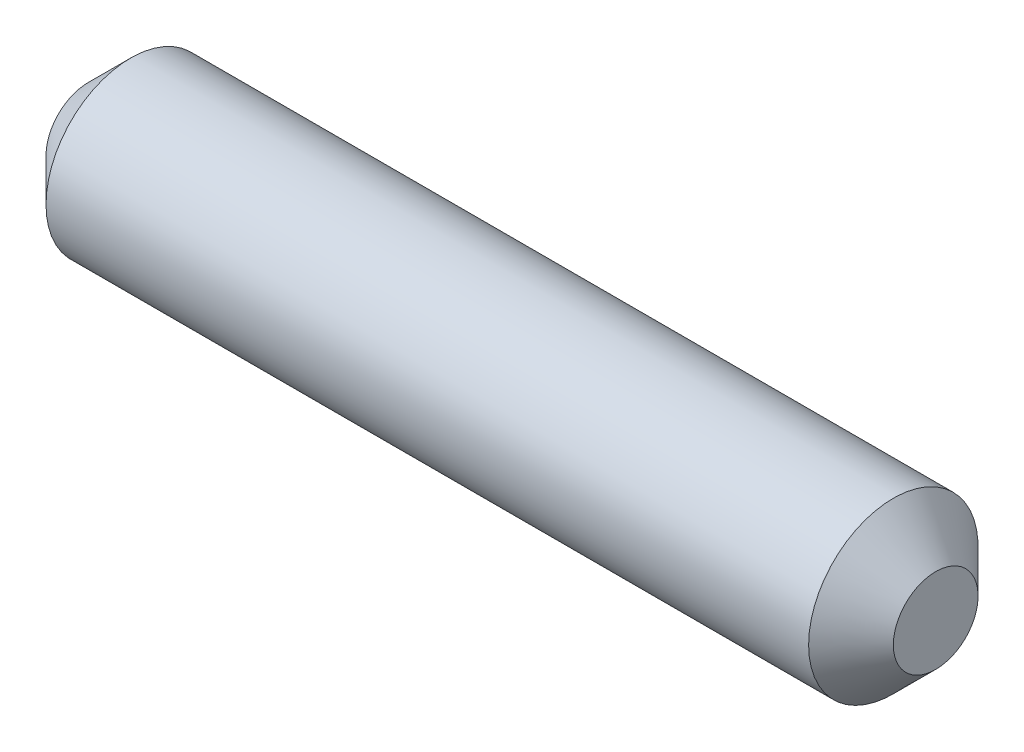
ISO-10303-21;
HEADER;
FILE_DESCRIPTION(('STEP AP214'),'2;1');
FILE_NAME('part.step','',(''),(''),'','','');
FILE_SCHEMA(('AUTOMOTIVE_DESIGN { 1 0 10303 214 1 1 1 1 }'));
ENDSEC;
DATA;
#1=APPLICATION_CONTEXT('core data for automotive mechanical design processes');
#2=APPLICATION_PROTOCOL_DEFINITION('international standard','automotive_design',2000,#1);
#3=PRODUCT_CONTEXT('',#1,'mechanical');
#4=PRODUCT('Part','Part','',(#3));
#5=PRODUCT_RELATED_PRODUCT_CATEGORY('part','',(#4));
#6=PRODUCT_DEFINITION_FORMATION('','',#4);
#7=PRODUCT_DEFINITION_CONTEXT('part definition',#1,'design');
#8=PRODUCT_DEFINITION('design','',#6,#7);
#9=PRODUCT_DEFINITION_SHAPE('','',#8);
#10=(LENGTH_UNIT() NAMED_UNIT(*) SI_UNIT(.MILLI.,.METRE.));
#11=(NAMED_UNIT(*) PLANE_ANGLE_UNIT() SI_UNIT($,.RADIAN.));
#12=(NAMED_UNIT(*) SI_UNIT($,.STERADIAN.) SOLID_ANGLE_UNIT());
#13=UNCERTAINTY_MEASURE_WITH_UNIT(LENGTH_MEASURE(1.E-05),#10,'distance_accuracy_value','');
#14=(GEOMETRIC_REPRESENTATION_CONTEXT(3) GLOBAL_UNCERTAINTY_ASSIGNED_CONTEXT((#13)) GLOBAL_UNIT_ASSIGNED_CONTEXT((#10,
#11,#12)) REPRESENTATION_CONTEXT('',''));
#15=CARTESIAN_POINT('',(0.,0.,0.));
#16=DIRECTION('',(0.,0.,1.));
#17=DIRECTION('',(1.,0.,0.));
#18=AXIS2_PLACEMENT_3D('',#15,#16,#17);
#19=CARTESIAN_POINT('',(0.,0.,0.));
#20=DIRECTION('',(1.,0.,0.));
#21=DIRECTION('',(0.,0.,-1.));
#22=AXIS2_PLACEMENT_3D('',#19,#20,#21);
#23=PLANE('',#22);
#24=CARTESIAN_POINT('',(0.,0.,0.));
#25=DIRECTION('',(-1.,0.,0.));
#26=DIRECTION('',(0.,0.,1.));
#27=AXIS2_PLACEMENT_3D('',#24,#25,#26);
#28=CIRCLE('',#27,1.);
#29=CARTESIAN_POINT('',(0.,0.,1.));
#30=VERTEX_POINT('',#29);
#31=EDGE_CURVE('E10',#30,#30,#28,.T.);
#32=ORIENTED_EDGE('',*,*,#31,.T.);
#33=EDGE_LOOP('',(#32));
#34=FACE_BOUND('',#33,.T.);
#35=ADVANCED_FACE('F29',(#34),#23,.F.);
#36=CARTESIAN_POINT('',(1.,0.,0.));
#37=DIRECTION('',(1.,0.,0.));
#38=DIRECTION('',(0.,0.,-1.));
#39=AXIS2_PLACEMENT_3D('',#36,#37,#38);
#40=CONICAL_SURFACE('',#39,2.,0.785398163397448);
#41=ORIENTED_EDGE('',*,*,#31,.F.);
#42=EDGE_LOOP('',(#41));
#43=FACE_BOUND('',#42,.T.);
#44=CARTESIAN_POINT('',(1.,0.,0.));
#45=DIRECTION('',(-1.,0.,0.));
#46=DIRECTION('',(0.,0.,1.));
#47=AXIS2_PLACEMENT_3D('',#44,#45,#46);
#48=CIRCLE('',#47,2.);
#49=CARTESIAN_POINT('',(1.,0.,2.));
#50=VERTEX_POINT('',#49);
#51=EDGE_CURVE('E35',#50,#50,#48,.T.);
#52=ORIENTED_EDGE('',*,*,#51,.T.);
#53=EDGE_LOOP('',(#52));
#54=FACE_BOUND('',#53,.T.);
#55=ADVANCED_FACE('F61',(#43,#54),#40,.T.);
#56=CARTESIAN_POINT('',(-64.5454939341421,0.,0.));
#57=DIRECTION('',(-1.,0.,0.));
#58=DIRECTION('',(0.,0.,1.));
#59=AXIS2_PLACEMENT_3D('',#56,#57,#58);
#60=CYLINDRICAL_SURFACE('',#59,2.);
#61=ORIENTED_EDGE('',*,*,#51,.F.);
#62=EDGE_LOOP('',(#61));
#63=FACE_BOUND('',#62,.T.);
#64=CARTESIAN_POINT('',(19.,0.,0.));
#65=DIRECTION('',(-1.,0.,0.));
#66=DIRECTION('',(0.,0.,1.));
#67=AXIS2_PLACEMENT_3D('',#64,#65,#66);
#68=CIRCLE('',#67,2.);
#69=CARTESIAN_POINT('',(19.,0.,2.));
#70=VERTEX_POINT('',#69);
#71=EDGE_CURVE('E39',#70,#70,#68,.T.);
#72=ORIENTED_EDGE('',*,*,#71,.T.);
#73=EDGE_LOOP('',(#72));
#74=FACE_BOUND('',#73,.T.);
#75=ADVANCED_FACE('F57',(#63,#74),#60,.T.);
#76=CARTESIAN_POINT('',(20.,0.,0.));
#77=DIRECTION('',(-1.,0.,0.));
#78=DIRECTION('',(0.,0.,1.));
#79=AXIS2_PLACEMENT_3D('',#76,#77,#78);
#80=CONICAL_SURFACE('',#79,1.,0.785398163397448);
#81=ORIENTED_EDGE('',*,*,#71,.F.);
#82=EDGE_LOOP('',(#81));
#83=FACE_BOUND('',#82,.T.);
#84=CARTESIAN_POINT('',(20.,0.,0.));
#85=DIRECTION('',(-1.,0.,0.));
#86=DIRECTION('',(0.,0.,1.));
#87=AXIS2_PLACEMENT_3D('',#84,#85,#86);
#88=CIRCLE('',#87,1.);
#89=CARTESIAN_POINT('',(20.,0.,1.));
#90=VERTEX_POINT('',#89);
#91=EDGE_CURVE('E43',#90,#90,#88,.T.);
#92=ORIENTED_EDGE('',*,*,#91,.T.);
#93=EDGE_LOOP('',(#92));
#94=FACE_BOUND('',#93,.T.);
#95=ADVANCED_FACE('F49',(#83,#94),#80,.T.);
#96=CARTESIAN_POINT('',(20.,1.,0.));
#97=DIRECTION('',(-1.,0.,0.));
#98=DIRECTION('',(0.,0.,1.));
#99=AXIS2_PLACEMENT_3D('',#96,#97,#98);
#100=PLANE('',#99);
#101=ORIENTED_EDGE('',*,*,#91,.F.);
#102=EDGE_LOOP('',(#101));
#103=FACE_BOUND('',#102,.T.);
#104=ADVANCED_FACE('F51',(#103),#100,.F.);
#105=CLOSED_SHELL('',(#35,#55,#75,#95,#104));
#106=MANIFOLD_SOLID_BREP('B2',#105);
#107=ADVANCED_BREP_SHAPE_REPRESENTATION('',(#18,#106),#14);
#108=SHAPE_DEFINITION_REPRESENTATION(#9,#107);
ENDSEC;
END-ISO-10303-21;
